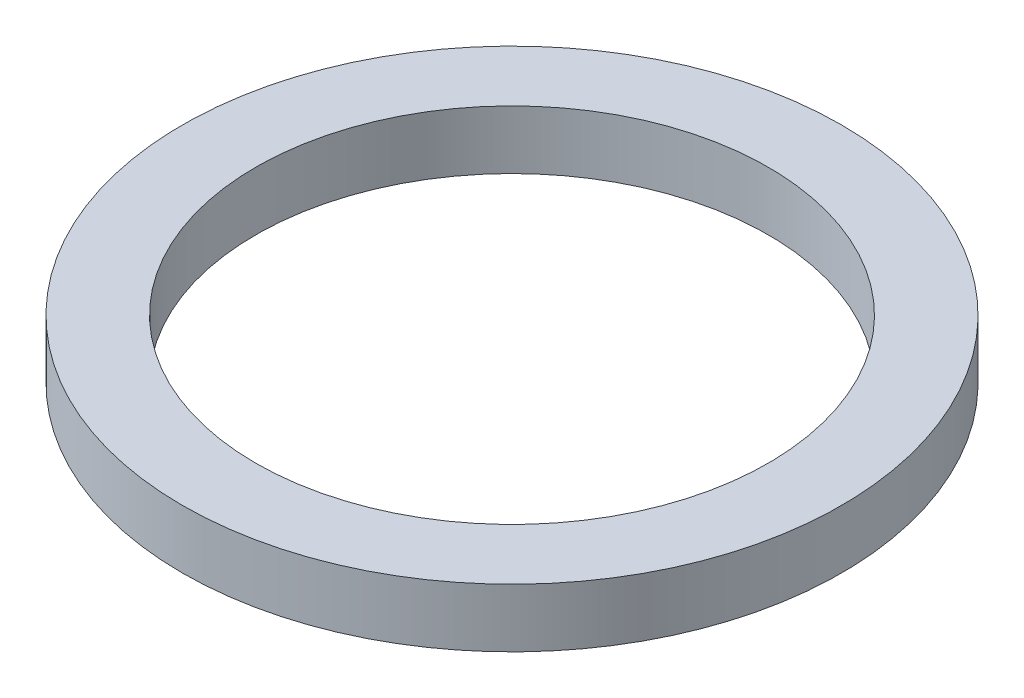
ISO-10303-21;
HEADER;
FILE_DESCRIPTION(('STEP AP214'),'2;1');
FILE_NAME('part.step','',(''),(''),'','','');
FILE_SCHEMA(('AUTOMOTIVE_DESIGN { 1 0 10303 214 1 1 1 1 }'));
ENDSEC;
DATA;
#1=APPLICATION_CONTEXT('core data for automotive mechanical design processes');
#2=APPLICATION_PROTOCOL_DEFINITION('international standard','automotive_design',2000,#1);
#3=PRODUCT_CONTEXT('',#1,'mechanical');
#4=PRODUCT('Part','Part','',(#3));
#5=PRODUCT_RELATED_PRODUCT_CATEGORY('part','',(#4));
#6=PRODUCT_DEFINITION_FORMATION('','',#4);
#7=PRODUCT_DEFINITION_CONTEXT('part definition',#1,'design');
#8=PRODUCT_DEFINITION('design','',#6,#7);
#9=PRODUCT_DEFINITION_SHAPE('','',#8);
#10=(LENGTH_UNIT() NAMED_UNIT(*) SI_UNIT(.MILLI.,.METRE.));
#11=(NAMED_UNIT(*) PLANE_ANGLE_UNIT() SI_UNIT($,.RADIAN.));
#12=(NAMED_UNIT(*) SI_UNIT($,.STERADIAN.) SOLID_ANGLE_UNIT());
#13=UNCERTAINTY_MEASURE_WITH_UNIT(LENGTH_MEASURE(1.E-05),#10,'distance_accuracy_value','');
#14=(GEOMETRIC_REPRESENTATION_CONTEXT(3) GLOBAL_UNCERTAINTY_ASSIGNED_CONTEXT((#13)) GLOBAL_UNIT_ASSIGNED_CONTEXT((#10,
#11,#12)) REPRESENTATION_CONTEXT('',''));
#15=CARTESIAN_POINT('',(0.,0.,0.));
#16=DIRECTION('',(0.,0.,1.));
#17=DIRECTION('',(1.,0.,0.));
#18=AXIS2_PLACEMENT_3D('',#15,#16,#17);
#19=CARTESIAN_POINT('',(0.,8.,0.));
#20=DIRECTION('',(0.,-1.,0.));
#21=DIRECTION('',(0.,0.,-1.));
#22=AXIS2_PLACEMENT_3D('',#19,#20,#21);
#23=CYLINDRICAL_SURFACE('',#22,45.);
#24=CARTESIAN_POINT('',(0.,8.,0.));
#25=DIRECTION('',(0.,1.,0.));
#26=DIRECTION('',(0.,0.,1.));
#27=AXIS2_PLACEMENT_3D('',#24,#25,#26);
#28=CIRCLE('',#27,45.);
#29=CARTESIAN_POINT('',(0.,8.,45.));
#30=VERTEX_POINT('',#29);
#31=EDGE_CURVE('E10',#30,#30,#28,.T.);
#32=ORIENTED_EDGE('',*,*,#31,.F.);
#33=EDGE_LOOP('',(#32));
#34=FACE_BOUND('',#33,.T.);
#35=CARTESIAN_POINT('',(0.,0.,0.));
#36=DIRECTION('',(0.,1.,0.));
#37=DIRECTION('',(0.,0.,1.));
#38=AXIS2_PLACEMENT_3D('',#35,#36,#37);
#39=CIRCLE('',#38,45.);
#40=CARTESIAN_POINT('',(0.,0.,45.));
#41=VERTEX_POINT('',#40);
#42=EDGE_CURVE('E37',#41,#41,#39,.T.);
#43=ORIENTED_EDGE('',*,*,#42,.T.);
#44=EDGE_LOOP('',(#43));
#45=FACE_BOUND('',#44,.T.);
#46=ADVANCED_FACE('F40',(#34,#45),#23,.T.);
#47=CARTESIAN_POINT('',(0.,8.,0.));
#48=DIRECTION('',(0.,1.,0.));
#49=DIRECTION('',(0.,0.,1.));
#50=AXIS2_PLACEMENT_3D('',#47,#48,#49);
#51=PLANE('',#50);
#52=CARTESIAN_POINT('',(0.,8.,0.));
#53=DIRECTION('',(0.,1.,0.));
#54=DIRECTION('',(0.,0.,1.));
#55=AXIS2_PLACEMENT_3D('',#52,#53,#54);
#56=CIRCLE('',#55,35.);
#57=CARTESIAN_POINT('',(0.,8.,35.));
#58=VERTEX_POINT('',#57);
#59=EDGE_CURVE('E50',#58,#58,#56,.T.);
#60=ORIENTED_EDGE('',*,*,#59,.F.);
#61=EDGE_LOOP('',(#60));
#62=FACE_BOUND('',#61,.T.);
#63=ORIENTED_EDGE('',*,*,#31,.T.);
#64=EDGE_LOOP('',(#63));
#65=FACE_BOUND('',#64,.T.);
#66=ADVANCED_FACE('F59',(#62,#65),#51,.T.);
#67=CARTESIAN_POINT('',(0.,0.,0.));
#68=DIRECTION('',(0.,1.,0.));
#69=DIRECTION('',(0.,0.,1.));
#70=AXIS2_PLACEMENT_3D('',#67,#68,#69);
#71=PLANE('',#70);
#72=CARTESIAN_POINT('',(0.,0.,0.));
#73=DIRECTION('',(0.,1.,0.));
#74=DIRECTION('',(0.,0.,1.));
#75=AXIS2_PLACEMENT_3D('',#72,#73,#74);
#76=CIRCLE('',#75,35.);
#77=CARTESIAN_POINT('',(0.,0.,35.));
#78=VERTEX_POINT('',#77);
#79=EDGE_CURVE('E47',#78,#78,#76,.T.);
#80=ORIENTED_EDGE('',*,*,#79,.T.);
#81=EDGE_LOOP('',(#80));
#82=FACE_BOUND('',#81,.T.);
#83=ORIENTED_EDGE('',*,*,#42,.F.);
#84=EDGE_LOOP('',(#83));
#85=FACE_BOUND('',#84,.T.);
#86=ADVANCED_FACE('F58',(#82,#85),#71,.F.);
#87=CARTESIAN_POINT('',(0.,8.,0.));
#88=DIRECTION('',(0.,-1.,0.));
#89=DIRECTION('',(0.,0.,-1.));
#90=AXIS2_PLACEMENT_3D('',#87,#88,#89);
#91=CYLINDRICAL_SURFACE('',#90,35.);
#92=ORIENTED_EDGE('',*,*,#59,.T.);
#93=EDGE_LOOP('',(#92));
#94=FACE_BOUND('',#93,.T.);
#95=ORIENTED_EDGE('',*,*,#79,.F.);
#96=EDGE_LOOP('',(#95));
#97=FACE_BOUND('',#96,.T.);
#98=ADVANCED_FACE('F54',(#94,#97),#91,.F.);
#99=CLOSED_SHELL('',(#46,#66,#86,#98));
#100=MANIFOLD_SOLID_BREP('B2',#99);
#101=ADVANCED_BREP_SHAPE_REPRESENTATION('',(#18,#100),#14);
#102=SHAPE_DEFINITION_REPRESENTATION(#9,#101);
ENDSEC;
END-ISO-10303-21;
